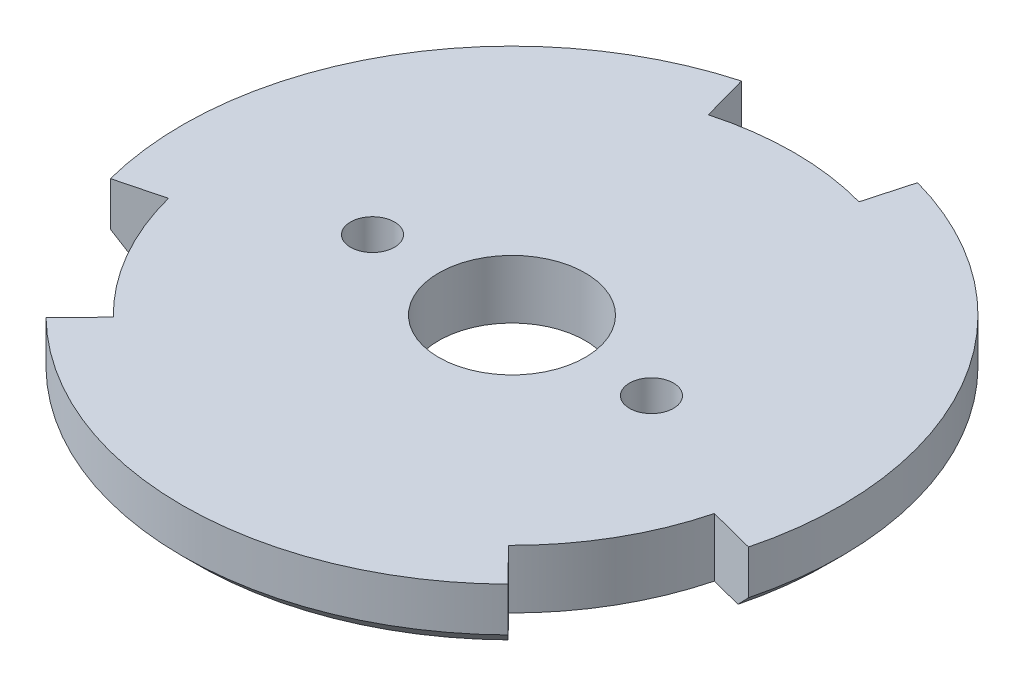
ISO-10303-21;
HEADER;
FILE_DESCRIPTION(('STEP AP214'),'2;1');
FILE_NAME('part.step','',(''),(''),'','','');
FILE_SCHEMA(('AUTOMOTIVE_DESIGN { 1 0 10303 214 1 1 1 1 }'));
ENDSEC;
DATA;
#1=APPLICATION_CONTEXT('core data for automotive mechanical design processes');
#2=APPLICATION_PROTOCOL_DEFINITION('international standard','automotive_design',2000,#1);
#3=PRODUCT_CONTEXT('',#1,'mechanical');
#4=PRODUCT('Part','Part','',(#3));
#5=PRODUCT_RELATED_PRODUCT_CATEGORY('part','',(#4));
#6=PRODUCT_DEFINITION_FORMATION('','',#4);
#7=PRODUCT_DEFINITION_CONTEXT('part definition',#1,'design');
#8=PRODUCT_DEFINITION('design','',#6,#7);
#9=PRODUCT_DEFINITION_SHAPE('','',#8);
#10=(LENGTH_UNIT() NAMED_UNIT(*) SI_UNIT(.MILLI.,.METRE.));
#11=(NAMED_UNIT(*) PLANE_ANGLE_UNIT() SI_UNIT($,.RADIAN.));
#12=(NAMED_UNIT(*) SI_UNIT($,.STERADIAN.) SOLID_ANGLE_UNIT());
#13=UNCERTAINTY_MEASURE_WITH_UNIT(LENGTH_MEASURE(1.E-05),#10,'distance_accuracy_value','');
#14=(GEOMETRIC_REPRESENTATION_CONTEXT(3) GLOBAL_UNCERTAINTY_ASSIGNED_CONTEXT((#13)) GLOBAL_UNIT_ASSIGNED_CONTEXT((#10,
#11,#12)) REPRESENTATION_CONTEXT('',''));
#15=CARTESIAN_POINT('',(0.,0.,0.));
#16=DIRECTION('',(0.,0.,1.));
#17=DIRECTION('',(1.,0.,0.));
#18=AXIS2_PLACEMENT_3D('',#15,#16,#17);
#19=CARTESIAN_POINT('',(0.,4.,0.));
#20=DIRECTION('',(0.,-1.,0.));
#21=DIRECTION('',(0.,0.,-1.));
#22=AXIS2_PLACEMENT_3D('',#19,#20,#21);
#23=CYLINDRICAL_SURFACE('',#22,22.5);
#24=CARTESIAN_POINT('',(0.,1.00000000000001,0.));
#25=DIRECTION('',(0.,1.,0.));
#26=DIRECTION('',(0.,0.,1.));
#27=AXIS2_PLACEMENT_3D('',#24,#25,#26);
#28=CIRCLE('',#27,22.5);
#29=CARTESIAN_POINT('',(21.7833219085074,1.00000000000002,5.63355009122508));
#30=VERTEX_POINT('',#29);
#31=CARTESIAN_POINT('',(6.01286346176064,1.00000000000002,-21.6816851971941));
#32=VERTEX_POINT('',#31);
#33=EDGE_CURVE('E298',#30,#32,#28,.T.);
#34=ORIENTED_EDGE('',*,*,#33,.T.);
#35=DIRECTION('',(0.,1.,0.));
#36=VECTOR('',#35,1.);
#37=CARTESIAN_POINT('',(6.01286346176063,0.,-21.6816851971941));
#38=LINE('',#37,#36);
#39=CARTESIAN_POINT('',(6.01286346176063,4.,-21.6816851971941));
#40=VERTEX_POINT('',#39);
#41=EDGE_CURVE('E187',#32,#40,#38,.T.);
#42=ORIENTED_EDGE('',*,*,#41,.T.);
#43=CARTESIAN_POINT('',(0.,4.,0.));
#44=DIRECTION('',(0.,1.,0.));
#45=DIRECTION('',(0.,0.,1.));
#46=AXIS2_PLACEMENT_3D('',#43,#44,#45);
#47=CIRCLE('',#46,22.5);
#48=CARTESIAN_POINT('',(21.7833219085074,4.,5.63355009122507));
#49=VERTEX_POINT('',#48);
#50=EDGE_CURVE('E292',#49,#40,#47,.T.);
#51=ORIENTED_EDGE('',*,*,#50,.F.);
#52=DIRECTION('',(0.,1.,0.));
#53=VECTOR('',#52,1.);
#54=CARTESIAN_POINT('',(21.7833219085074,0.,5.63355009122507));
#55=LINE('',#54,#53);
#56=EDGE_CURVE('E207',#30,#49,#55,.T.);
#57=ORIENTED_EDGE('',*,*,#56,.F.);
#58=EDGE_LOOP('',(#34,#42,#51,#57));
#59=FACE_BOUND('',#58,.T.);
#60=ADVANCED_FACE('F40',(#59),#23,.T.);
#61=CARTESIAN_POINT('',(-15.7704584467468,1.00000000000001,16.048135105969));
#62=VERTEX_POINT('',#61);
#63=CARTESIAN_POINT('',(15.7704584467468,1.00000000000001,16.048135105969));
#64=VERTEX_POINT('',#63);
#65=EDGE_CURVE('E293',#62,#64,#28,.T.);
#66=ORIENTED_EDGE('',*,*,#65,.T.);
#67=DIRECTION('',(0.,1.,0.));
#68=VECTOR('',#67,1.);
#69=CARTESIAN_POINT('',(15.7704584467468,0.,16.048135105969));
#70=LINE('',#69,#68);
#71=CARTESIAN_POINT('',(15.7704584467468,4.,16.048135105969));
#72=VERTEX_POINT('',#71);
#73=EDGE_CURVE('E184',#64,#72,#70,.T.);
#74=ORIENTED_EDGE('',*,*,#73,.T.);
#75=CARTESIAN_POINT('',(-15.7704584467467,4.,16.048135105969));
#76=VERTEX_POINT('',#75);
#77=EDGE_CURVE('E284',#76,#72,#47,.T.);
#78=ORIENTED_EDGE('',*,*,#77,.F.);
#79=DIRECTION('',(0.,1.,0.));
#80=VECTOR('',#79,1.);
#81=CARTESIAN_POINT('',(-15.7704584467467,0.,16.048135105969));
#82=LINE('',#81,#80);
#83=EDGE_CURVE('E242',#62,#76,#82,.T.);
#84=ORIENTED_EDGE('',*,*,#83,.F.);
#85=EDGE_LOOP('',(#66,#74,#78,#84));
#86=FACE_BOUND('',#85,.T.);
#87=ADVANCED_FACE('F358',(#86),#23,.T.);
#88=CARTESIAN_POINT('',(0.,1.00000000000001,0.));
#89=DIRECTION('',(0.,1.,0.));
#90=DIRECTION('',(0.,0.,1.));
#91=AXIS2_PLACEMENT_3D('',#88,#89,#90);
#92=CONICAL_SURFACE('',#91,22.5,0.785398163397453);
#93=DIRECTION('',(0.188966067918213,0.707106781186544,-0.681389628021688));
#94=VECTOR('',#93,1.);
#95=CARTESIAN_POINT('',(0.,-21.4999999999998,0.));
#96=LINE('',#95,#94);
#97=CARTESIAN_POINT('',(5.74562508568238,0.,-20.7180547439854));
#98=VERTEX_POINT('',#97);
#99=EDGE_CURVE('E11',#32,#98,#96,.F.);
#100=ORIENTED_EDGE('',*,*,#99,.F.);
#101=ORIENTED_EDGE('',*,*,#33,.F.);
#102=DIRECTION('',(-0.684583761701118,-0.707106781186544,-0.177045398740416));
#103=VECTOR('',#102,1.);
#104=CARTESIAN_POINT('',(0.,-21.4999999999998,0.));
#105=LINE('',#104,#103);
#106=CARTESIAN_POINT('',(20.8151742681293,0.,5.38317008717062));
#107=VERTEX_POINT('',#106);
#108=EDGE_CURVE('E310',#107,#30,#105,.F.);
#109=ORIENTED_EDGE('',*,*,#108,.F.);
#110=CARTESIAN_POINT('',(0.,0.,0.));
#111=DIRECTION('',(0.,1.,0.));
#112=DIRECTION('',(0.,0.,1.));
#113=AXIS2_PLACEMENT_3D('',#110,#111,#112);
#114=CIRCLE('',#113,21.5);
#115=EDGE_CURVE('E303',#98,#107,#114,.F.);
#116=ORIENTED_EDGE('',*,*,#115,.F.);
#117=EDGE_LOOP('',(#100,#101,#109,#116));
#118=FACE_BOUND('',#117,.T.);
#119=ADVANCED_FACE('F335',(#118),#92,.T.);
#120=DIRECTION('',(0.495617693782905,0.707106781186544,0.504344229281272));
#121=VECTOR('',#120,1.);
#122=CARTESIAN_POINT('',(0.,-21.4999999999998,0.));
#123=LINE('',#122,#121);
#124=CARTESIAN_POINT('',(15.0695491824469,0.,15.3348846568148));
#125=VERTEX_POINT('',#124);
#126=EDGE_CURVE('E313',#64,#125,#123,.F.);
#127=ORIENTED_EDGE('',*,*,#126,.F.);
#128=ORIENTED_EDGE('',*,*,#65,.F.);
#129=DIRECTION('',(0.495617693782905,-0.707106781186544,-0.504344229281272));
#130=VECTOR('',#129,1.);
#131=CARTESIAN_POINT('',(0.,-21.4999999999998,0.));
#132=LINE('',#131,#130);
#133=CARTESIAN_POINT('',(-15.0695491824469,0.,15.3348846568148));
#134=VERTEX_POINT('',#133);
#135=EDGE_CURVE('E304',#134,#62,#132,.F.);
#136=ORIENTED_EDGE('',*,*,#135,.F.);
#137=EDGE_CURVE('E299',#125,#134,#114,.F.);
#138=ORIENTED_EDGE('',*,*,#137,.F.);
#139=EDGE_LOOP('',(#127,#128,#136,#138));
#140=FACE_BOUND('',#139,.T.);
#141=ADVANCED_FACE('F354',(#140),#92,.T.);
#142=CARTESIAN_POINT('',(0.,4.,0.));
#143=DIRECTION('',(0.,1.,0.));
#144=DIRECTION('',(0.,0.,1.));
#145=AXIS2_PLACEMENT_3D('',#142,#143,#144);
#146=PLANE('',#145);
#147=DIRECTION('',(0.267238376078251,0.,-0.963630453208625));
#148=VECTOR('',#147,1.);
#149=CARTESIAN_POINT('',(6.01286346176063,4.,-21.6816851971941));
#150=LINE('',#149,#148);
#151=CARTESIAN_POINT('',(5.14433873950632,4.,-18.549886224266));
#152=VERTEX_POINT('',#151);
#153=EDGE_CURVE('E174',#152,#40,#150,.T.);
#154=ORIENTED_EDGE('',*,*,#153,.F.);
#155=CARTESIAN_POINT('',(0.,4.,0.));
#156=DIRECTION('',(0.,-1.,0.));
#157=DIRECTION('',(0.,0.,1.));
#158=AXIS2_PLACEMENT_3D('',#155,#156,#157);
#159=CIRCLE('',#158,19.25);
#160=CARTESIAN_POINT('',(-5.14433873950631,4.,-18.549886224266));
#161=VERTEX_POINT('',#160);
#162=EDGE_CURVE('E177',#161,#152,#159,.T.);
#163=ORIENTED_EDGE('',*,*,#162,.F.);
#164=DIRECTION('',(0.267238376078251,0.,0.963630453208625));
#165=VECTOR('',#164,1.);
#166=CARTESIAN_POINT('',(-6.01286346176063,4.,-21.6816851971941));
#167=LINE('',#166,#165);
#168=CARTESIAN_POINT('',(-6.01286346176063,4.,-21.6816851971941));
#169=VERTEX_POINT('',#168);
#170=EDGE_CURVE('E150',#169,#161,#167,.T.);
#171=ORIENTED_EDGE('',*,*,#170,.F.);
#172=CARTESIAN_POINT('',(-21.7833219085074,4.,5.63355009122509));
#173=VERTEX_POINT('',#172);
#174=EDGE_CURVE('E291',#169,#173,#47,.T.);
#175=ORIENTED_EDGE('',*,*,#174,.T.);
#176=DIRECTION('',(-0.968147640378106,0.,0.250380004054448));
#177=VECTOR('',#176,1.);
#178=CARTESIAN_POINT('',(-21.7833219085074,4.,5.63355009122509));
#179=LINE('',#178,#177);
#180=CARTESIAN_POINT('',(-18.6368420772785,4.,4.81981507804813));
#181=VERTEX_POINT('',#180);
#182=EDGE_CURVE('E235',#181,#173,#179,.T.);
#183=ORIENTED_EDGE('',*,*,#182,.F.);
#184=CARTESIAN_POINT('',(0.,4.,0.));
#185=DIRECTION('',(0.,-1.,0.));
#186=DIRECTION('',(0.,0.,1.));
#187=AXIS2_PLACEMENT_3D('',#184,#185,#186);
#188=CIRCLE('',#187,19.25);
#189=CARTESIAN_POINT('',(-13.4925033377722,4.,13.7300711462179));
#190=VERTEX_POINT('',#189);
#191=EDGE_CURVE('E247',#190,#181,#188,.T.);
#192=ORIENTED_EDGE('',*,*,#191,.F.);
#193=DIRECTION('',(0.700909264299856,0.,-0.713250449154176));
#194=VECTOR('',#193,1.);
#195=CARTESIAN_POINT('',(-15.7704584467467,4.,16.048135105969));
#196=LINE('',#195,#194);
#197=EDGE_CURVE('E243',#76,#190,#196,.T.);
#198=ORIENTED_EDGE('',*,*,#197,.F.);
#199=ORIENTED_EDGE('',*,*,#77,.T.);
#200=DIRECTION('',(0.700909264299856,0.,0.713250449154176));
#201=VECTOR('',#200,1.);
#202=CARTESIAN_POINT('',(15.7704584467468,4.,16.048135105969));
#203=LINE('',#202,#201);
#204=CARTESIAN_POINT('',(13.4925033377722,4.,13.7300711462179));
#205=VERTEX_POINT('',#204);
#206=EDGE_CURVE('E199',#205,#72,#203,.T.);
#207=ORIENTED_EDGE('',*,*,#206,.F.);
#208=CARTESIAN_POINT('',(0.,4.,0.));
#209=DIRECTION('',(0.,-1.,0.));
#210=DIRECTION('',(0.,0.,1.));
#211=AXIS2_PLACEMENT_3D('',#208,#209,#210);
#212=CIRCLE('',#211,19.25);
#213=CARTESIAN_POINT('',(18.6368420772785,4.,4.81981507804812));
#214=VERTEX_POINT('',#213);
#215=EDGE_CURVE('E212',#214,#205,#212,.T.);
#216=ORIENTED_EDGE('',*,*,#215,.F.);
#217=DIRECTION('',(-0.968147640378106,0.,-0.250380004054447));
#218=VECTOR('',#217,1.);
#219=CARTESIAN_POINT('',(21.7833219085074,4.,5.63355009122507));
#220=LINE('',#219,#218);
#221=EDGE_CURVE('E208',#49,#214,#220,.T.);
#222=ORIENTED_EDGE('',*,*,#221,.F.);
#223=ORIENTED_EDGE('',*,*,#50,.T.);
#224=EDGE_LOOP('',(#154,#163,#171,#175,#183,#192,#198,#199,#207,#216,#222,#223));
#225=FACE_BOUND('',#224,.T.);
#226=CARTESIAN_POINT('',(-9.525,4.,0.));
#227=DIRECTION('',(0.,1.,0.));
#228=DIRECTION('',(0.,0.,1.));
#229=AXIS2_PLACEMENT_3D('',#226,#227,#228);
#230=CIRCLE('',#229,1.5);
#231=CARTESIAN_POINT('',(-9.525,4.,1.5));
#232=VERTEX_POINT('',#231);
#233=EDGE_CURVE('E272',#232,#232,#230,.T.);
#234=ORIENTED_EDGE('',*,*,#233,.F.);
#235=EDGE_LOOP('',(#234));
#236=FACE_BOUND('',#235,.T.);
#237=CARTESIAN_POINT('',(0.,4.,0.));
#238=DIRECTION('',(0.,1.,0.));
#239=DIRECTION('',(0.,0.,1.));
#240=AXIS2_PLACEMENT_3D('',#237,#238,#239);
#241=CIRCLE('',#240,5.);
#242=CARTESIAN_POINT('',(0.,4.,5.));
#243=VERTEX_POINT('',#242);
#244=EDGE_CURVE('E280',#243,#243,#241,.T.);
#245=ORIENTED_EDGE('',*,*,#244,.F.);
#246=EDGE_LOOP('',(#245));
#247=FACE_BOUND('',#246,.T.);
#248=CARTESIAN_POINT('',(9.525,4.,0.));
#249=DIRECTION('',(0.,1.,0.));
#250=DIRECTION('',(0.,0.,-1.));
#251=AXIS2_PLACEMENT_3D('',#248,#249,#250);
#252=CIRCLE('',#251,1.5);
#253=CARTESIAN_POINT('',(9.525,4.,-1.5));
#254=VERTEX_POINT('',#253);
#255=EDGE_CURVE('E264',#254,#254,#252,.T.);
#256=ORIENTED_EDGE('',*,*,#255,.F.);
#257=EDGE_LOOP('',(#256));
#258=FACE_BOUND('',#257,.T.);
#259=ADVANCED_FACE('F366',(#225,#236,#247,#258),#146,.T.);
#260=CARTESIAN_POINT('',(0.,0.,0.));
#261=DIRECTION('',(0.,1.,0.));
#262=DIRECTION('',(0.,0.,1.));
#263=AXIS2_PLACEMENT_3D('',#260,#261,#262);
#264=PLANE('',#263);
#265=CARTESIAN_POINT('',(0.,0.,0.));
#266=DIRECTION('',(0.,-1.,0.));
#267=DIRECTION('',(0.,0.,1.));
#268=AXIS2_PLACEMENT_3D('',#265,#266,#267);
#269=CIRCLE('',#268,19.25);
#270=CARTESIAN_POINT('',(-5.14433873950631,0.,-18.549886224266));
#271=VERTEX_POINT('',#270);
#272=CARTESIAN_POINT('',(5.14433873950632,0.,-18.549886224266));
#273=VERTEX_POINT('',#272);
#274=EDGE_CURVE('E159',#271,#273,#269,.T.);
#275=ORIENTED_EDGE('',*,*,#274,.T.);
#276=DIRECTION('',(0.267238376078251,0.,-0.963630453208625));
#277=VECTOR('',#276,1.);
#278=CARTESIAN_POINT('',(6.01286346176063,0.,-21.6816851971941));
#279=LINE('',#278,#277);
#280=EDGE_CURVE('E165',#273,#98,#279,.T.);
#281=ORIENTED_EDGE('',*,*,#280,.T.);
#282=ORIENTED_EDGE('',*,*,#115,.T.);
#283=DIRECTION('',(-0.968147640378106,0.,-0.250380004054447));
#284=VECTOR('',#283,1.);
#285=CARTESIAN_POINT('',(21.7833219085074,0.,5.63355009122507));
#286=LINE('',#285,#284);
#287=CARTESIAN_POINT('',(18.6368420772785,0.,4.81981507804812));
#288=VERTEX_POINT('',#287);
#289=EDGE_CURVE('E57',#107,#288,#286,.T.);
#290=ORIENTED_EDGE('',*,*,#289,.T.);
#291=CARTESIAN_POINT('',(0.,0.,0.));
#292=DIRECTION('',(0.,-1.,0.));
#293=DIRECTION('',(0.,0.,1.));
#294=AXIS2_PLACEMENT_3D('',#291,#292,#293);
#295=CIRCLE('',#294,19.25);
#296=CARTESIAN_POINT('',(13.4925033377722,0.,13.7300711462179));
#297=VERTEX_POINT('',#296);
#298=EDGE_CURVE('E198',#288,#297,#295,.T.);
#299=ORIENTED_EDGE('',*,*,#298,.T.);
#300=DIRECTION('',(0.700909264299856,0.,0.713250449154176));
#301=VECTOR('',#300,1.);
#302=CARTESIAN_POINT('',(15.7704584467468,0.,16.048135105969));
#303=LINE('',#302,#301);
#304=EDGE_CURVE('E203',#297,#125,#303,.T.);
#305=ORIENTED_EDGE('',*,*,#304,.T.);
#306=ORIENTED_EDGE('',*,*,#137,.T.);
#307=DIRECTION('',(0.700909264299856,0.,-0.713250449154176));
#308=VECTOR('',#307,1.);
#309=CARTESIAN_POINT('',(-15.7704584467467,0.,16.048135105969));
#310=LINE('',#309,#308);
#311=CARTESIAN_POINT('',(-13.4925033377722,0.,13.7300711462179));
#312=VERTEX_POINT('',#311);
#313=EDGE_CURVE('E230',#134,#312,#310,.T.);
#314=ORIENTED_EDGE('',*,*,#313,.T.);
#315=CARTESIAN_POINT('',(0.,0.,0.));
#316=DIRECTION('',(0.,-1.,0.));
#317=DIRECTION('',(0.,0.,1.));
#318=AXIS2_PLACEMENT_3D('',#315,#316,#317);
#319=CIRCLE('',#318,19.25);
#320=CARTESIAN_POINT('',(-18.6368420772785,0.,4.81981507804813));
#321=VERTEX_POINT('',#320);
#322=EDGE_CURVE('E234',#312,#321,#319,.T.);
#323=ORIENTED_EDGE('',*,*,#322,.T.);
#324=DIRECTION('',(-0.968147640378106,0.,0.250380004054448));
#325=VECTOR('',#324,1.);
#326=CARTESIAN_POINT('',(-21.7833219085074,0.,5.63355009122509));
#327=LINE('',#326,#325);
#328=CARTESIAN_POINT('',(-20.8151742681293,0.,5.38317008717064));
#329=VERTEX_POINT('',#328);
#330=EDGE_CURVE('E239',#321,#329,#327,.T.);
#331=ORIENTED_EDGE('',*,*,#330,.T.);
#332=CARTESIAN_POINT('',(-5.74562508568238,0.,-20.7180547439854));
#333=VERTEX_POINT('',#332);
#334=EDGE_CURVE('E172',#329,#333,#114,.F.);
#335=ORIENTED_EDGE('',*,*,#334,.T.);
#336=DIRECTION('',(0.267238376078251,0.,0.963630453208625));
#337=VECTOR('',#336,1.);
#338=CARTESIAN_POINT('',(-6.01286346176063,0.,-21.6816851971941));
#339=LINE('',#338,#337);
#340=EDGE_CURVE('E65',#333,#271,#339,.T.);
#341=ORIENTED_EDGE('',*,*,#340,.T.);
#342=EDGE_LOOP('',(#275,#281,#282,#290,#299,#305,#306,#314,#323,#331,#335,#341));
#343=FACE_BOUND('',#342,.T.);
#344=CARTESIAN_POINT('',(0.,0.,0.));
#345=DIRECTION('',(0.,1.,0.));
#346=DIRECTION('',(0.,0.,1.));
#347=AXIS2_PLACEMENT_3D('',#344,#345,#346);
#348=CIRCLE('',#347,5.);
#349=CARTESIAN_POINT('',(0.,0.,5.));
#350=VERTEX_POINT('',#349);
#351=EDGE_CURVE('E276',#350,#350,#348,.T.);
#352=ORIENTED_EDGE('',*,*,#351,.T.);
#353=EDGE_LOOP('',(#352));
#354=FACE_BOUND('',#353,.T.);
#355=CARTESIAN_POINT('',(-9.525,0.,0.));
#356=DIRECTION('',(0.,1.,0.));
#357=DIRECTION('',(0.,0.,1.));
#358=AXIS2_PLACEMENT_3D('',#355,#356,#357);
#359=CIRCLE('',#358,1.5);
#360=CARTESIAN_POINT('',(-9.525,0.,1.5));
#361=VERTEX_POINT('',#360);
#362=EDGE_CURVE('E268',#361,#361,#359,.T.);
#363=ORIENTED_EDGE('',*,*,#362,.T.);
#364=EDGE_LOOP('',(#363));
#365=FACE_BOUND('',#364,.T.);
#366=CARTESIAN_POINT('',(9.525,0.,0.));
#367=DIRECTION('',(0.,1.,0.));
#368=DIRECTION('',(0.,0.,-1.));
#369=AXIS2_PLACEMENT_3D('',#366,#367,#368);
#370=CIRCLE('',#369,1.5);
#371=CARTESIAN_POINT('',(9.525,0.,-1.5));
#372=VERTEX_POINT('',#371);
#373=EDGE_CURVE('E191',#372,#372,#370,.T.);
#374=ORIENTED_EDGE('',*,*,#373,.T.);
#375=EDGE_LOOP('',(#374));
#376=FACE_BOUND('',#375,.T.);
#377=ADVANCED_FACE('F168',(#343,#354,#365,#376),#264,.F.);
#378=ORIENTED_EDGE('',*,*,#174,.F.);
#379=DIRECTION('',(0.,1.,0.));
#380=VECTOR('',#379,1.);
#381=CARTESIAN_POINT('',(-6.01286346176063,0.,-21.6816851971941));
#382=LINE('',#381,#380);
#383=CARTESIAN_POINT('',(-6.01286346176064,1.00000000000002,-21.6816851971941));
#384=VERTEX_POINT('',#383);
#385=EDGE_CURVE('E156',#384,#169,#382,.T.);
#386=ORIENTED_EDGE('',*,*,#385,.F.);
#387=CARTESIAN_POINT('',(-21.7833219085074,0.999999999999997,5.63355009122509));
#388=VERTEX_POINT('',#387);
#389=EDGE_CURVE('E297',#384,#388,#28,.T.);
#390=ORIENTED_EDGE('',*,*,#389,.T.);
#391=DIRECTION('',(0.,1.,0.));
#392=VECTOR('',#391,1.);
#393=CARTESIAN_POINT('',(-21.7833219085074,0.,5.63355009122509));
#394=LINE('',#393,#392);
#395=EDGE_CURVE('E213',#388,#173,#394,.T.);
#396=ORIENTED_EDGE('',*,*,#395,.T.);
#397=EDGE_LOOP('',(#378,#386,#390,#396));
#398=FACE_BOUND('',#397,.T.);
#399=ADVANCED_FACE('F322',(#398),#23,.T.);
#400=CARTESIAN_POINT('',(0.,4.,0.));
#401=DIRECTION('',(0.,-1.,0.));
#402=DIRECTION('',(0.,0.,-1.));
#403=AXIS2_PLACEMENT_3D('',#400,#401,#402);
#404=CYLINDRICAL_SURFACE('',#403,5.);
#405=ORIENTED_EDGE('',*,*,#244,.T.);
#406=EDGE_LOOP('',(#405));
#407=FACE_BOUND('',#406,.T.);
#408=ORIENTED_EDGE('',*,*,#351,.F.);
#409=EDGE_LOOP('',(#408));
#410=FACE_BOUND('',#409,.T.);
#411=ADVANCED_FACE('F394',(#407,#410),#404,.F.);
#412=CARTESIAN_POINT('',(-9.525,4.,0.));
#413=DIRECTION('',(0.,-1.,0.));
#414=DIRECTION('',(0.,0.,-1.));
#415=AXIS2_PLACEMENT_3D('',#412,#413,#414);
#416=CYLINDRICAL_SURFACE('',#415,1.5);
#417=ORIENTED_EDGE('',*,*,#233,.T.);
#418=EDGE_LOOP('',(#417));
#419=FACE_BOUND('',#418,.T.);
#420=ORIENTED_EDGE('',*,*,#362,.F.);
#421=EDGE_LOOP('',(#420));
#422=FACE_BOUND('',#421,.T.);
#423=ADVANCED_FACE('F399',(#419,#422),#416,.F.);
#424=CARTESIAN_POINT('',(9.525,4.,0.));
#425=DIRECTION('',(0.,-1.,0.));
#426=DIRECTION('',(0.,0.,-1.));
#427=AXIS2_PLACEMENT_3D('',#424,#425,#426);
#428=CYLINDRICAL_SURFACE('',#427,1.5);
#429=ORIENTED_EDGE('',*,*,#255,.T.);
#430=EDGE_LOOP('',(#429));
#431=FACE_BOUND('',#430,.T.);
#432=ORIENTED_EDGE('',*,*,#373,.F.);
#433=EDGE_LOOP('',(#432));
#434=FACE_BOUND('',#433,.T.);
#435=ADVANCED_FACE('F409',(#431,#434),#428,.F.);
#436=DIRECTION('',(0.188966067918213,-0.707106781186544,0.681389628021688));
#437=VECTOR('',#436,1.);
#438=CARTESIAN_POINT('',(0.,-21.4999999999998,0.));
#439=LINE('',#438,#437);
#440=EDGE_CURVE('E50',#333,#384,#439,.F.);
#441=ORIENTED_EDGE('',*,*,#440,.F.);
#442=ORIENTED_EDGE('',*,*,#334,.F.);
#443=DIRECTION('',(-0.684583761701117,0.707106781186544,0.177045398740416));
#444=VECTOR('',#443,1.);
#445=CARTESIAN_POINT('',(0.,-21.4999999999998,0.));
#446=LINE('',#445,#444);
#447=EDGE_CURVE('E307',#388,#329,#446,.F.);
#448=ORIENTED_EDGE('',*,*,#447,.F.);
#449=ORIENTED_EDGE('',*,*,#389,.F.);
#450=EDGE_LOOP('',(#441,#442,#448,#449));
#451=FACE_BOUND('',#450,.T.);
#452=ADVANCED_FACE('F43',(#451),#92,.T.);
#453=CARTESIAN_POINT('',(-21.7833219085074,0.,5.63355009122509));
#454=DIRECTION('',(-0.250380004054448,0.,-0.968147640378106));
#455=DIRECTION('',(-0.968147640378106,0.,0.250380004054448));
#456=AXIS2_PLACEMENT_3D('',#453,#454,#455);
#457=PLANE('',#456);
#458=ORIENTED_EDGE('',*,*,#447,.T.);
#459=ORIENTED_EDGE('',*,*,#330,.F.);
#460=DIRECTION('',(0.,1.,0.));
#461=VECTOR('',#460,1.);
#462=CARTESIAN_POINT('',(-18.6368420772785,0.,4.81981507804813));
#463=LINE('',#462,#461);
#464=EDGE_CURVE('E256',#321,#181,#463,.T.);
#465=ORIENTED_EDGE('',*,*,#464,.T.);
#466=ORIENTED_EDGE('',*,*,#182,.T.);
#467=ORIENTED_EDGE('',*,*,#395,.F.);
#468=EDGE_LOOP('',(#458,#459,#465,#466,#467));
#469=FACE_BOUND('',#468,.T.);
#470=ADVANCED_FACE('F374',(#469),#457,.F.);
#471=CARTESIAN_POINT('',(0.,0.,0.));
#472=DIRECTION('',(0.,1.,0.));
#473=DIRECTION('',(0.,0.,1.));
#474=AXIS2_PLACEMENT_3D('',#471,#472,#473);
#475=CYLINDRICAL_SURFACE('',#474,19.25);
#476=ORIENTED_EDGE('',*,*,#191,.T.);
#477=ORIENTED_EDGE('',*,*,#464,.F.);
#478=ORIENTED_EDGE('',*,*,#322,.F.);
#479=DIRECTION('',(0.,1.,0.));
#480=VECTOR('',#479,1.);
#481=CARTESIAN_POINT('',(-13.4925033377722,0.,13.7300711462179));
#482=LINE('',#481,#480);
#483=EDGE_CURVE('E259',#312,#190,#482,.T.);
#484=ORIENTED_EDGE('',*,*,#483,.T.);
#485=EDGE_LOOP('',(#476,#477,#478,#484));
#486=FACE_BOUND('',#485,.T.);
#487=ADVANCED_FACE('F370',(#486),#475,.T.);
#488=CARTESIAN_POINT('',(-15.7704584467467,0.,16.048135105969));
#489=DIRECTION('',(0.713250449154176,0.,0.700909264299856));
#490=DIRECTION('',(0.700909264299856,0.,-0.713250449154176));
#491=AXIS2_PLACEMENT_3D('',#488,#489,#490);
#492=PLANE('',#491);
#493=ORIENTED_EDGE('',*,*,#135,.T.);
#494=ORIENTED_EDGE('',*,*,#83,.T.);
#495=ORIENTED_EDGE('',*,*,#197,.T.);
#496=ORIENTED_EDGE('',*,*,#483,.F.);
#497=ORIENTED_EDGE('',*,*,#313,.F.);
#498=EDGE_LOOP('',(#493,#494,#495,#496,#497));
#499=FACE_BOUND('',#498,.T.);
#500=ADVANCED_FACE('F362',(#499),#492,.F.);
#501=CARTESIAN_POINT('',(15.7704584467468,0.,16.048135105969));
#502=DIRECTION('',(-0.713250449154176,0.,0.700909264299856));
#503=DIRECTION('',(0.700909264299856,0.,0.713250449154176));
#504=AXIS2_PLACEMENT_3D('',#501,#502,#503);
#505=PLANE('',#504);
#506=ORIENTED_EDGE('',*,*,#126,.T.);
#507=ORIENTED_EDGE('',*,*,#304,.F.);
#508=DIRECTION('',(0.,1.,0.));
#509=VECTOR('',#508,1.);
#510=CARTESIAN_POINT('',(13.4925033377722,0.,13.7300711462179));
#511=LINE('',#510,#509);
#512=EDGE_CURVE('E222',#297,#205,#511,.T.);
#513=ORIENTED_EDGE('',*,*,#512,.T.);
#514=ORIENTED_EDGE('',*,*,#206,.T.);
#515=ORIENTED_EDGE('',*,*,#73,.F.);
#516=EDGE_LOOP('',(#506,#507,#513,#514,#515));
#517=FACE_BOUND('',#516,.T.);
#518=ADVANCED_FACE('F350',(#517),#505,.F.);
#519=CARTESIAN_POINT('',(0.,0.,0.));
#520=DIRECTION('',(0.,1.,0.));
#521=DIRECTION('',(0.,0.,1.));
#522=AXIS2_PLACEMENT_3D('',#519,#520,#521);
#523=CYLINDRICAL_SURFACE('',#522,19.25);
#524=ORIENTED_EDGE('',*,*,#215,.T.);
#525=ORIENTED_EDGE('',*,*,#512,.F.);
#526=ORIENTED_EDGE('',*,*,#298,.F.);
#527=DIRECTION('',(0.,1.,0.));
#528=VECTOR('',#527,1.);
#529=CARTESIAN_POINT('',(18.6368420772785,0.,4.81981507804812));
#530=LINE('',#529,#528);
#531=EDGE_CURVE('E225',#288,#214,#530,.T.);
#532=ORIENTED_EDGE('',*,*,#531,.T.);
#533=EDGE_LOOP('',(#524,#525,#526,#532));
#534=FACE_BOUND('',#533,.T.);
#535=ADVANCED_FACE('F346',(#534),#523,.T.);
#536=CARTESIAN_POINT('',(21.7833219085074,0.,5.63355009122507));
#537=DIRECTION('',(0.250380004054447,0.,-0.968147640378106));
#538=DIRECTION('',(-0.968147640378106,0.,-0.250380004054447));
#539=AXIS2_PLACEMENT_3D('',#536,#537,#538);
#540=PLANE('',#539);
#541=ORIENTED_EDGE('',*,*,#108,.T.);
#542=ORIENTED_EDGE('',*,*,#56,.T.);
#543=ORIENTED_EDGE('',*,*,#221,.T.);
#544=ORIENTED_EDGE('',*,*,#531,.F.);
#545=ORIENTED_EDGE('',*,*,#289,.F.);
#546=EDGE_LOOP('',(#541,#542,#543,#544,#545));
#547=FACE_BOUND('',#546,.T.);
#548=ADVANCED_FACE('F378',(#547),#540,.F.);
#549=CARTESIAN_POINT('',(6.01286346176063,0.,-21.6816851971941));
#550=DIRECTION('',(0.963630453208625,0.,0.267238376078251));
#551=DIRECTION('',(0.267238376078251,0.,-0.963630453208625));
#552=AXIS2_PLACEMENT_3D('',#549,#550,#551);
#553=PLANE('',#552);
#554=ORIENTED_EDGE('',*,*,#99,.T.);
#555=ORIENTED_EDGE('',*,*,#280,.F.);
#556=DIRECTION('',(0.,1.,0.));
#557=VECTOR('',#556,1.);
#558=CARTESIAN_POINT('',(5.14433873950632,0.,-18.549886224266));
#559=LINE('',#558,#557);
#560=EDGE_CURVE('E155',#273,#152,#559,.T.);
#561=ORIENTED_EDGE('',*,*,#560,.T.);
#562=ORIENTED_EDGE('',*,*,#153,.T.);
#563=ORIENTED_EDGE('',*,*,#41,.F.);
#564=EDGE_LOOP('',(#554,#555,#561,#562,#563));
#565=FACE_BOUND('',#564,.T.);
#566=ADVANCED_FACE('F339',(#565),#553,.F.);
#567=CARTESIAN_POINT('',(0.,0.,0.));
#568=DIRECTION('',(0.,1.,0.));
#569=DIRECTION('',(0.,0.,1.));
#570=AXIS2_PLACEMENT_3D('',#567,#568,#569);
#571=CYLINDRICAL_SURFACE('',#570,19.25);
#572=ORIENTED_EDGE('',*,*,#162,.T.);
#573=ORIENTED_EDGE('',*,*,#560,.F.);
#574=ORIENTED_EDGE('',*,*,#274,.F.);
#575=DIRECTION('',(0.,1.,0.));
#576=VECTOR('',#575,1.);
#577=CARTESIAN_POINT('',(-5.14433873950631,0.,-18.549886224266));
#578=LINE('',#577,#576);
#579=EDGE_CURVE('E146',#271,#161,#578,.T.);
#580=ORIENTED_EDGE('',*,*,#579,.T.);
#581=EDGE_LOOP('',(#572,#573,#574,#580));
#582=FACE_BOUND('',#581,.T.);
#583=ADVANCED_FACE('F160',(#582),#571,.T.);
#584=CARTESIAN_POINT('',(-6.01286346176063,0.,-21.6816851971941));
#585=DIRECTION('',(-0.963630453208625,0.,0.267238376078251));
#586=DIRECTION('',(0.267238376078251,0.,0.963630453208625));
#587=AXIS2_PLACEMENT_3D('',#584,#585,#586);
#588=PLANE('',#587);
#589=ORIENTED_EDGE('',*,*,#440,.T.);
#590=ORIENTED_EDGE('',*,*,#385,.T.);
#591=ORIENTED_EDGE('',*,*,#170,.T.);
#592=ORIENTED_EDGE('',*,*,#579,.F.);
#593=ORIENTED_EDGE('',*,*,#340,.F.);
#594=EDGE_LOOP('',(#589,#590,#591,#592,#593));
#595=FACE_BOUND('',#594,.T.);
#596=ADVANCED_FACE('F148',(#595),#588,.F.);
#597=CLOSED_SHELL('',(#60,#87,#119,#141,#259,#377,#399,#411,#423,#435,#452,#470,#487,#500,#518,
#535,#548,#566,#583,#596));
#598=MANIFOLD_SOLID_BREP('B2',#597);
#599=ADVANCED_BREP_SHAPE_REPRESENTATION('',(#18,#598),#14);
#600=SHAPE_DEFINITION_REPRESENTATION(#9,#599);
ENDSEC;
END-ISO-10303-21;
